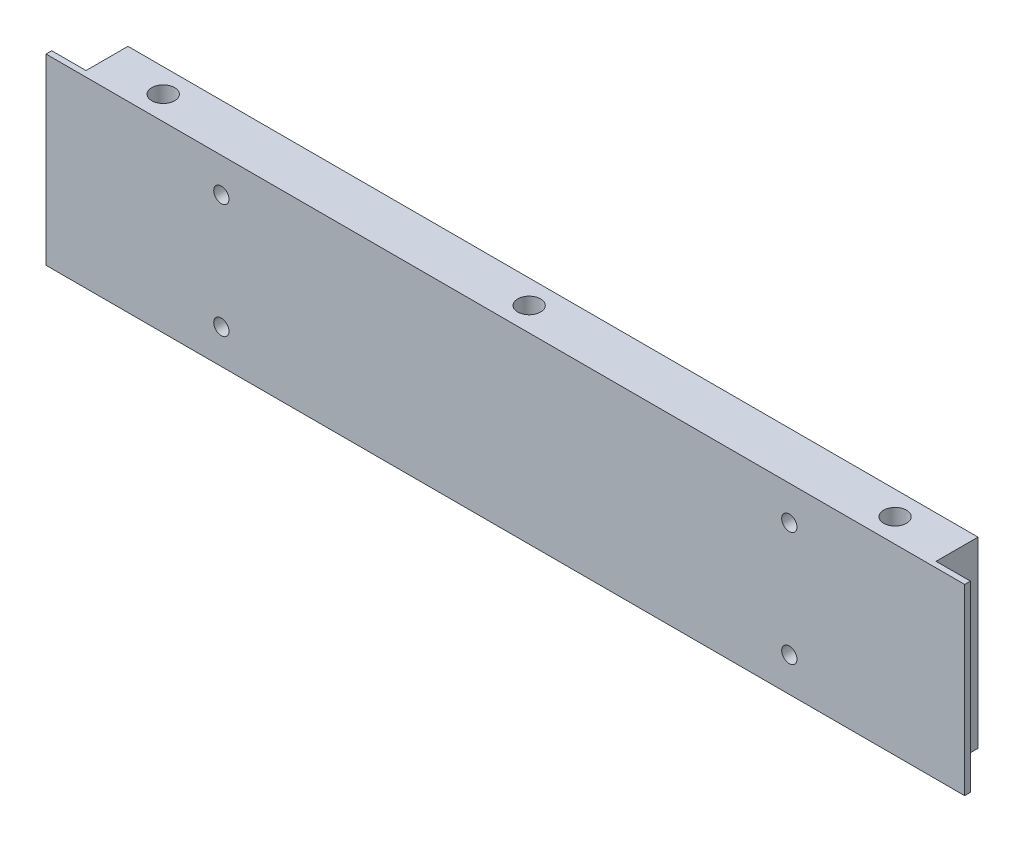
ISO-10303-21;
HEADER;
FILE_DESCRIPTION(('STEP AP214'),'2;1');
FILE_NAME('part.step','',(''),(''),'','','');
FILE_SCHEMA(('AUTOMOTIVE_DESIGN { 1 0 10303 214 1 1 1 1 }'));
ENDSEC;
DATA;
#1=APPLICATION_CONTEXT('core data for automotive mechanical design processes');
#2=APPLICATION_PROTOCOL_DEFINITION('international standard','automotive_design',2000,#1);
#3=PRODUCT_CONTEXT('',#1,'mechanical');
#4=PRODUCT('Part','Part','',(#3));
#5=PRODUCT_RELATED_PRODUCT_CATEGORY('part','',(#4));
#6=PRODUCT_DEFINITION_FORMATION('','',#4);
#7=PRODUCT_DEFINITION_CONTEXT('part definition',#1,'design');
#8=PRODUCT_DEFINITION('design','',#6,#7);
#9=PRODUCT_DEFINITION_SHAPE('','',#8);
#10=(LENGTH_UNIT() NAMED_UNIT(*) SI_UNIT(.MILLI.,.METRE.));
#11=(NAMED_UNIT(*) PLANE_ANGLE_UNIT() SI_UNIT($,.RADIAN.));
#12=(NAMED_UNIT(*) SI_UNIT($,.STERADIAN.) SOLID_ANGLE_UNIT());
#13=UNCERTAINTY_MEASURE_WITH_UNIT(LENGTH_MEASURE(1.E-05),#10,'distance_accuracy_value','');
#14=(GEOMETRIC_REPRESENTATION_CONTEXT(3) GLOBAL_UNCERTAINTY_ASSIGNED_CONTEXT((#13)) GLOBAL_UNIT_ASSIGNED_CONTEXT((#10,
#11,#12)) REPRESENTATION_CONTEXT('',''));
#15=CARTESIAN_POINT('',(0.,0.,0.));
#16=DIRECTION('',(0.,0.,1.));
#17=DIRECTION('',(1.,0.,0.));
#18=AXIS2_PLACEMENT_3D('',#15,#16,#17);
#19=CARTESIAN_POINT('',(0.,-48.,12.5));
#20=DIRECTION('',(0.,0.,1.));
#21=DIRECTION('',(1.,0.,0.));
#22=AXIS2_PLACEMENT_3D('',#19,#20,#21);
#23=PLANE('',#22);
#24=CARTESIAN_POINT('',(46.,-8.99999999999999,12.5));
#25=DIRECTION('',(0.,0.,1.));
#26=DIRECTION('',(1.,0.,0.));
#27=AXIS2_PLACEMENT_3D('',#24,#25,#26);
#28=CIRCLE('',#27,2.);
#29=CARTESIAN_POINT('',(48.,-8.99999999999999,12.5));
#30=VERTEX_POINT('',#29);
#31=EDGE_CURVE('E171',#30,#30,#28,.T.);
#32=ORIENTED_EDGE('',*,*,#31,.F.);
#33=EDGE_LOOP('',(#32));
#34=FACE_BOUND('',#33,.T.);
#35=CARTESIAN_POINT('',(195.,-39.,12.5));
#36=DIRECTION('',(0.,0.,1.));
#37=DIRECTION('',(-1.,0.,0.));
#38=AXIS2_PLACEMENT_3D('',#35,#36,#37);
#39=CIRCLE('',#38,2.00000000000002);
#40=CARTESIAN_POINT('',(193.,-39.,12.5));
#41=VERTEX_POINT('',#40);
#42=EDGE_CURVE('E120',#41,#41,#39,.T.);
#43=ORIENTED_EDGE('',*,*,#42,.F.);
#44=EDGE_LOOP('',(#43));
#45=FACE_BOUND('',#44,.T.);
#46=DIRECTION('',(0.,-1.,0.));
#47=VECTOR('',#46,1.);
#48=CARTESIAN_POINT('',(0.,0.,12.5));
#49=LINE('',#48,#47);
#50=CARTESIAN_POINT('',(0.,0.,12.5));
#51=VERTEX_POINT('',#50);
#52=CARTESIAN_POINT('',(0.,-48.,12.5));
#53=VERTEX_POINT('',#52);
#54=EDGE_CURVE('E122',#51,#53,#49,.T.);
#55=ORIENTED_EDGE('',*,*,#54,.T.);
#56=DIRECTION('',(1.,0.,0.));
#57=VECTOR('',#56,1.);
#58=CARTESIAN_POINT('',(0.,-48.,12.5));
#59=LINE('',#58,#57);
#60=CARTESIAN_POINT('',(241.,-48.,12.5));
#61=VERTEX_POINT('',#60);
#62=EDGE_CURVE('E146',#53,#61,#59,.T.);
#63=ORIENTED_EDGE('',*,*,#62,.T.);
#64=DIRECTION('',(0.,1.,0.));
#65=VECTOR('',#64,1.);
#66=CARTESIAN_POINT('',(241.,0.,12.5));
#67=LINE('',#66,#65);
#68=CARTESIAN_POINT('',(241.,0.,12.5));
#69=VERTEX_POINT('',#68);
#70=EDGE_CURVE('E144',#61,#69,#67,.T.);
#71=ORIENTED_EDGE('',*,*,#70,.T.);
#72=DIRECTION('',(-1.,0.,0.));
#73=VECTOR('',#72,1.);
#74=CARTESIAN_POINT('',(0.,0.,12.5));
#75=LINE('',#74,#73);
#76=EDGE_CURVE('E128',#69,#51,#75,.T.);
#77=ORIENTED_EDGE('',*,*,#76,.T.);
#78=EDGE_LOOP('',(#55,#63,#71,#77));
#79=FACE_BOUND('',#78,.T.);
#80=CARTESIAN_POINT('',(195.,-8.99999999999999,12.5));
#81=DIRECTION('',(0.,0.,1.));
#82=DIRECTION('',(-1.,0.,0.));
#83=AXIS2_PLACEMENT_3D('',#80,#81,#82);
#84=CIRCLE('',#83,2.00000000000002);
#85=CARTESIAN_POINT('',(193.,-8.99999999999999,12.5));
#86=VERTEX_POINT('',#85);
#87=EDGE_CURVE('E177',#86,#86,#84,.T.);
#88=ORIENTED_EDGE('',*,*,#87,.F.);
#89=EDGE_LOOP('',(#88));
#90=FACE_BOUND('',#89,.T.);
#91=CARTESIAN_POINT('',(46.,-39.,12.5));
#92=DIRECTION('',(0.,0.,1.));
#93=DIRECTION('',(1.,0.,0.));
#94=AXIS2_PLACEMENT_3D('',#91,#92,#93);
#95=CIRCLE('',#94,2.);
#96=CARTESIAN_POINT('',(48.,-39.,12.5));
#97=VERTEX_POINT('',#96);
#98=EDGE_CURVE('E165',#97,#97,#95,.T.);
#99=ORIENTED_EDGE('',*,*,#98,.F.);
#100=EDGE_LOOP('',(#99));
#101=FACE_BOUND('',#100,.T.);
#102=ADVANCED_FACE('F30',(#34,#45,#79,#90,#101),#23,.T.);
#103=CARTESIAN_POINT('',(0.,-48.,0.));
#104=DIRECTION('',(0.,0.,1.));
#105=DIRECTION('',(1.,0.,0.));
#106=AXIS2_PLACEMENT_3D('',#103,#104,#105);
#107=PLANE('',#106);
#108=CARTESIAN_POINT('',(46.,-8.99999999999999,0.));
#109=DIRECTION('',(0.,0.,1.));
#110=DIRECTION('',(1.,0.,0.));
#111=AXIS2_PLACEMENT_3D('',#108,#109,#110);
#112=CIRCLE('',#111,2.);
#113=CARTESIAN_POINT('',(48.,-8.99999999999999,0.));
#114=VERTEX_POINT('',#113);
#115=EDGE_CURVE('E168',#114,#114,#112,.T.);
#116=ORIENTED_EDGE('',*,*,#115,.T.);
#117=EDGE_LOOP('',(#116));
#118=FACE_BOUND('',#117,.T.);
#119=CARTESIAN_POINT('',(195.,-39.,0.));
#120=DIRECTION('',(0.,0.,1.));
#121=DIRECTION('',(-1.,0.,0.));
#122=AXIS2_PLACEMENT_3D('',#119,#120,#121);
#123=CIRCLE('',#122,2.00000000000002);
#124=CARTESIAN_POINT('',(193.,-39.,0.));
#125=VERTEX_POINT('',#124);
#126=EDGE_CURVE('E125',#125,#125,#123,.T.);
#127=ORIENTED_EDGE('',*,*,#126,.T.);
#128=EDGE_LOOP('',(#127));
#129=FACE_BOUND('',#128,.T.);
#130=DIRECTION('',(1.,0.,0.));
#131=VECTOR('',#130,1.);
#132=CARTESIAN_POINT('',(0.,-48.,0.));
#133=LINE('',#132,#131);
#134=CARTESIAN_POINT('',(9.00000000000001,-48.,0.));
#135=VERTEX_POINT('',#134);
#136=CARTESIAN_POINT('',(232.,-48.,0.));
#137=VERTEX_POINT('',#136);
#138=EDGE_CURVE('E114',#135,#137,#133,.T.);
#139=ORIENTED_EDGE('',*,*,#138,.F.);
#140=DIRECTION('',(0.,1.,0.));
#141=VECTOR('',#140,1.);
#142=CARTESIAN_POINT('',(9.00000000000001,-48.,0.));
#143=LINE('',#142,#141);
#144=CARTESIAN_POINT('',(9.00000000000001,0.,0.));
#145=VERTEX_POINT('',#144);
#146=EDGE_CURVE('E98',#135,#145,#143,.T.);
#147=ORIENTED_EDGE('',*,*,#146,.T.);
#148=DIRECTION('',(-1.,0.,0.));
#149=VECTOR('',#148,1.);
#150=CARTESIAN_POINT('',(0.,0.,0.));
#151=LINE('',#150,#149);
#152=CARTESIAN_POINT('',(232.,0.,0.));
#153=VERTEX_POINT('',#152);
#154=EDGE_CURVE('E119',#153,#145,#151,.T.);
#155=ORIENTED_EDGE('',*,*,#154,.F.);
#156=DIRECTION('',(0.,1.,0.));
#157=VECTOR('',#156,1.);
#158=CARTESIAN_POINT('',(232.,-48.,0.));
#159=LINE('',#158,#157);
#160=EDGE_CURVE('E53',#137,#153,#159,.T.);
#161=ORIENTED_EDGE('',*,*,#160,.F.);
#162=EDGE_LOOP('',(#139,#147,#155,#161));
#163=FACE_BOUND('',#162,.T.);
#164=CARTESIAN_POINT('',(195.,-8.99999999999999,0.));
#165=DIRECTION('',(0.,0.,1.));
#166=DIRECTION('',(-1.,0.,0.));
#167=AXIS2_PLACEMENT_3D('',#164,#165,#166);
#168=CIRCLE('',#167,2.00000000000002);
#169=CARTESIAN_POINT('',(193.,-8.99999999999999,0.));
#170=VERTEX_POINT('',#169);
#171=EDGE_CURVE('E174',#170,#170,#168,.T.);
#172=ORIENTED_EDGE('',*,*,#171,.T.);
#173=EDGE_LOOP('',(#172));
#174=FACE_BOUND('',#173,.T.);
#175=CARTESIAN_POINT('',(46.,-39.,0.));
#176=DIRECTION('',(0.,0.,1.));
#177=DIRECTION('',(1.,0.,0.));
#178=AXIS2_PLACEMENT_3D('',#175,#176,#177);
#179=CIRCLE('',#178,2.);
#180=CARTESIAN_POINT('',(48.,-39.,0.));
#181=VERTEX_POINT('',#180);
#182=EDGE_CURVE('E163',#181,#181,#179,.T.);
#183=ORIENTED_EDGE('',*,*,#182,.T.);
#184=EDGE_LOOP('',(#183));
#185=FACE_BOUND('',#184,.T.);
#186=ADVANCED_FACE('F117',(#118,#129,#163,#174,#185),#107,.F.);
#187=CARTESIAN_POINT('',(0.,0.,12.5));
#188=DIRECTION('',(1.,0.,0.));
#189=DIRECTION('',(0.,1.,0.));
#190=AXIS2_PLACEMENT_3D('',#187,#188,#189);
#191=PLANE('',#190);
#192=DIRECTION('',(0.,0.,-1.));
#193=VECTOR('',#192,1.);
#194=CARTESIAN_POINT('',(0.,0.,12.5));
#195=LINE('',#194,#193);
#196=CARTESIAN_POINT('',(0.,0.,11.));
#197=VERTEX_POINT('',#196);
#198=EDGE_CURVE('E131',#51,#197,#195,.T.);
#199=ORIENTED_EDGE('',*,*,#198,.T.);
#200=DIRECTION('',(0.,1.,0.));
#201=VECTOR('',#200,1.);
#202=CARTESIAN_POINT('',(0.,-48.,11.));
#203=LINE('',#202,#201);
#204=CARTESIAN_POINT('',(0.,-48.,11.));
#205=VERTEX_POINT('',#204);
#206=EDGE_CURVE('E45',#205,#197,#203,.T.);
#207=ORIENTED_EDGE('',*,*,#206,.F.);
#208=DIRECTION('',(0.,0.,-1.));
#209=VECTOR('',#208,1.);
#210=CARTESIAN_POINT('',(0.,-48.,12.5));
#211=LINE('',#210,#209);
#212=EDGE_CURVE('E11',#53,#205,#211,.T.);
#213=ORIENTED_EDGE('',*,*,#212,.F.);
#214=ORIENTED_EDGE('',*,*,#54,.F.);
#215=EDGE_LOOP('',(#199,#207,#213,#214));
#216=FACE_BOUND('',#215,.T.);
#217=ADVANCED_FACE('F32',(#216),#191,.F.);
#218=CARTESIAN_POINT('',(0.,-48.,12.5));
#219=DIRECTION('',(0.,1.,0.));
#220=DIRECTION('',(-1.,0.,0.));
#221=AXIS2_PLACEMENT_3D('',#218,#219,#220);
#222=PLANE('',#221);
#223=CARTESIAN_POINT('',(216.5,-48.,6.25000000000003));
#224=DIRECTION('',(0.,1.,0.));
#225=DIRECTION('',(-1.,0.,0.));
#226=AXIS2_PLACEMENT_3D('',#223,#224,#225);
#227=CIRCLE('',#226,3.00000000000002);
#228=CARTESIAN_POINT('',(213.5,-48.,6.25000000000003));
#229=VERTEX_POINT('',#228);
#230=EDGE_CURVE('E212',#229,#229,#227,.F.);
#231=ORIENTED_EDGE('',*,*,#230,.F.);
#232=EDGE_LOOP('',(#231));
#233=FACE_BOUND('',#232,.T.);
#234=CARTESIAN_POINT('',(24.5,-48.,6.25000000000003));
#235=DIRECTION('',(0.,1.,0.));
#236=DIRECTION('',(-1.,0.,0.));
#237=AXIS2_PLACEMENT_3D('',#234,#235,#236);
#238=CIRCLE('',#237,3.);
#239=CARTESIAN_POINT('',(21.5,-48.,6.25000000000003));
#240=VERTEX_POINT('',#239);
#241=EDGE_CURVE('E206',#240,#240,#238,.F.);
#242=ORIENTED_EDGE('',*,*,#241,.F.);
#243=EDGE_LOOP('',(#242));
#244=FACE_BOUND('',#243,.T.);
#245=CARTESIAN_POINT('',(120.5,-48.,6.25000000000003));
#246=DIRECTION('',(0.,1.,0.));
#247=DIRECTION('',(-1.,0.,0.));
#248=AXIS2_PLACEMENT_3D('',#245,#246,#247);
#249=CIRCLE('',#248,3.00000000000001);
#250=CARTESIAN_POINT('',(117.5,-48.,6.25000000000003));
#251=VERTEX_POINT('',#250);
#252=EDGE_CURVE('E199',#251,#251,#249,.F.);
#253=ORIENTED_EDGE('',*,*,#252,.F.);
#254=EDGE_LOOP('',(#253));
#255=FACE_BOUND('',#254,.T.);
#256=DIRECTION('',(1.,0.,0.));
#257=VECTOR('',#256,1.);
#258=CARTESIAN_POINT('',(9.,-48.,11.));
#259=LINE('',#258,#257);
#260=CARTESIAN_POINT('',(9.,-48.,11.));
#261=VERTEX_POINT('',#260);
#262=EDGE_CURVE('E109',#205,#261,#259,.T.);
#263=ORIENTED_EDGE('',*,*,#262,.T.);
#264=DIRECTION('',(0.,0.,-1.));
#265=VECTOR('',#264,1.);
#266=CARTESIAN_POINT('',(9.00000000000001,-48.,0.));
#267=LINE('',#266,#265);
#268=EDGE_CURVE('E101',#261,#135,#267,.T.);
#269=ORIENTED_EDGE('',*,*,#268,.T.);
#270=ORIENTED_EDGE('',*,*,#138,.T.);
#271=DIRECTION('',(0.,0.,1.));
#272=VECTOR('',#271,1.);
#273=CARTESIAN_POINT('',(232.,-48.,0.));
#274=LINE('',#273,#272);
#275=CARTESIAN_POINT('',(232.,-48.,11.));
#276=VERTEX_POINT('',#275);
#277=EDGE_CURVE('E150',#137,#276,#274,.T.);
#278=ORIENTED_EDGE('',*,*,#277,.T.);
#279=DIRECTION('',(1.,0.,0.));
#280=VECTOR('',#279,1.);
#281=CARTESIAN_POINT('',(232.,-48.,11.));
#282=LINE('',#281,#280);
#283=CARTESIAN_POINT('',(241.,-48.,11.));
#284=VERTEX_POINT('',#283);
#285=EDGE_CURVE('E149',#276,#284,#282,.T.);
#286=ORIENTED_EDGE('',*,*,#285,.T.);
#287=DIRECTION('',(0.,0.,-1.));
#288=VECTOR('',#287,1.);
#289=CARTESIAN_POINT('',(241.,-48.,12.5));
#290=LINE('',#289,#288);
#291=EDGE_CURVE('E38',#61,#284,#290,.T.);
#292=ORIENTED_EDGE('',*,*,#291,.F.);
#293=ORIENTED_EDGE('',*,*,#62,.F.);
#294=ORIENTED_EDGE('',*,*,#212,.T.);
#295=EDGE_LOOP('',(#263,#269,#270,#278,#286,#292,#293,#294));
#296=FACE_BOUND('',#295,.T.);
#297=ADVANCED_FACE('F112',(#233,#244,#255,#296),#222,.F.);
#298=CARTESIAN_POINT('',(241.,0.,12.5));
#299=DIRECTION('',(-1.,0.,0.));
#300=DIRECTION('',(0.,0.,1.));
#301=AXIS2_PLACEMENT_3D('',#298,#299,#300);
#302=PLANE('',#301);
#303=ORIENTED_EDGE('',*,*,#291,.T.);
#304=DIRECTION('',(0.,1.,0.));
#305=VECTOR('',#304,1.);
#306=CARTESIAN_POINT('',(241.,-48.,11.));
#307=LINE('',#306,#305);
#308=CARTESIAN_POINT('',(241.,0.,11.));
#309=VERTEX_POINT('',#308);
#310=EDGE_CURVE('E143',#284,#309,#307,.T.);
#311=ORIENTED_EDGE('',*,*,#310,.T.);
#312=DIRECTION('',(0.,0.,-1.));
#313=VECTOR('',#312,1.);
#314=CARTESIAN_POINT('',(241.,0.,12.5));
#315=LINE('',#314,#313);
#316=EDGE_CURVE('E134',#69,#309,#315,.T.);
#317=ORIENTED_EDGE('',*,*,#316,.F.);
#318=ORIENTED_EDGE('',*,*,#70,.F.);
#319=EDGE_LOOP('',(#303,#311,#317,#318));
#320=FACE_BOUND('',#319,.T.);
#321=ADVANCED_FACE('F141',(#320),#302,.F.);
#322=CARTESIAN_POINT('',(0.,0.,12.5));
#323=DIRECTION('',(0.,-1.,0.));
#324=DIRECTION('',(1.,0.,0.));
#325=AXIS2_PLACEMENT_3D('',#322,#323,#324);
#326=PLANE('',#325);
#327=CARTESIAN_POINT('',(216.5,0.,6.25000000000003));
#328=DIRECTION('',(0.,1.,0.));
#329=DIRECTION('',(1.,0.,0.));
#330=AXIS2_PLACEMENT_3D('',#327,#328,#329);
#331=CIRCLE('',#330,3.00000000000002);
#332=CARTESIAN_POINT('',(219.5,0.,6.25000000000003));
#333=VERTEX_POINT('',#332);
#334=EDGE_CURVE('E215',#333,#333,#331,.T.);
#335=ORIENTED_EDGE('',*,*,#334,.F.);
#336=EDGE_LOOP('',(#335));
#337=FACE_BOUND('',#336,.T.);
#338=CARTESIAN_POINT('',(24.5,0.,6.25000000000003));
#339=DIRECTION('',(0.,1.,0.));
#340=DIRECTION('',(-1.,0.,0.));
#341=AXIS2_PLACEMENT_3D('',#338,#339,#340);
#342=CIRCLE('',#341,3.);
#343=CARTESIAN_POINT('',(21.5,0.,6.25000000000003));
#344=VERTEX_POINT('',#343);
#345=EDGE_CURVE('E209',#344,#344,#342,.T.);
#346=ORIENTED_EDGE('',*,*,#345,.F.);
#347=EDGE_LOOP('',(#346));
#348=FACE_BOUND('',#347,.T.);
#349=CARTESIAN_POINT('',(120.5,0.,6.25000000000003));
#350=DIRECTION('',(0.,1.,0.));
#351=DIRECTION('',(-1.,0.,0.));
#352=AXIS2_PLACEMENT_3D('',#349,#350,#351);
#353=CIRCLE('',#352,3.00000000000001);
#354=CARTESIAN_POINT('',(117.5,0.,6.25000000000003));
#355=VERTEX_POINT('',#354);
#356=EDGE_CURVE('E203',#355,#355,#353,.T.);
#357=ORIENTED_EDGE('',*,*,#356,.F.);
#358=EDGE_LOOP('',(#357));
#359=FACE_BOUND('',#358,.T.);
#360=ORIENTED_EDGE('',*,*,#154,.T.);
#361=DIRECTION('',(0.,0.,-1.));
#362=VECTOR('',#361,1.);
#363=CARTESIAN_POINT('',(9.00000000000001,0.,0.));
#364=LINE('',#363,#362);
#365=CARTESIAN_POINT('',(9.,0.,11.));
#366=VERTEX_POINT('',#365);
#367=EDGE_CURVE('E104',#366,#145,#364,.T.);
#368=ORIENTED_EDGE('',*,*,#367,.F.);
#369=DIRECTION('',(1.,0.,0.));
#370=VECTOR('',#369,1.);
#371=CARTESIAN_POINT('',(9.,0.,11.));
#372=LINE('',#371,#370);
#373=EDGE_CURVE('E115',#197,#366,#372,.T.);
#374=ORIENTED_EDGE('',*,*,#373,.F.);
#375=ORIENTED_EDGE('',*,*,#198,.F.);
#376=ORIENTED_EDGE('',*,*,#76,.F.);
#377=ORIENTED_EDGE('',*,*,#316,.T.);
#378=DIRECTION('',(1.,0.,0.));
#379=VECTOR('',#378,1.);
#380=CARTESIAN_POINT('',(232.,0.,11.));
#381=LINE('',#380,#379);
#382=CARTESIAN_POINT('',(232.,0.,11.));
#383=VERTEX_POINT('',#382);
#384=EDGE_CURVE('E155',#383,#309,#381,.T.);
#385=ORIENTED_EDGE('',*,*,#384,.F.);
#386=DIRECTION('',(0.,0.,1.));
#387=VECTOR('',#386,1.);
#388=CARTESIAN_POINT('',(232.,0.,0.));
#389=LINE('',#388,#387);
#390=EDGE_CURVE('E158',#153,#383,#389,.T.);
#391=ORIENTED_EDGE('',*,*,#390,.F.);
#392=EDGE_LOOP('',(#360,#368,#374,#375,#376,#377,#385,#391));
#393=FACE_BOUND('',#392,.T.);
#394=ADVANCED_FACE('F192',(#337,#348,#359,#393),#326,.F.);
#395=CARTESIAN_POINT('',(195.,-39.,12.5));
#396=DIRECTION('',(0.,0.,-1.));
#397=DIRECTION('',(-1.,0.,0.));
#398=AXIS2_PLACEMENT_3D('',#395,#396,#397);
#399=CYLINDRICAL_SURFACE('',#398,2.00000000000002);
#400=ORIENTED_EDGE('',*,*,#42,.T.);
#401=EDGE_LOOP('',(#400));
#402=FACE_BOUND('',#401,.T.);
#403=ORIENTED_EDGE('',*,*,#126,.F.);
#404=EDGE_LOOP('',(#403));
#405=FACE_BOUND('',#404,.T.);
#406=ADVANCED_FACE('F224',(#402,#405),#399,.F.);
#407=CARTESIAN_POINT('',(195.,-8.99999999999999,12.5));
#408=DIRECTION('',(0.,0.,-1.));
#409=DIRECTION('',(-1.,0.,0.));
#410=AXIS2_PLACEMENT_3D('',#407,#408,#409);
#411=CYLINDRICAL_SURFACE('',#410,2.00000000000002);
#412=ORIENTED_EDGE('',*,*,#87,.T.);
#413=EDGE_LOOP('',(#412));
#414=FACE_BOUND('',#413,.T.);
#415=ORIENTED_EDGE('',*,*,#171,.F.);
#416=EDGE_LOOP('',(#415));
#417=FACE_BOUND('',#416,.T.);
#418=ADVANCED_FACE('F260',(#414,#417),#411,.F.);
#419=CARTESIAN_POINT('',(46.,-8.99999999999999,12.5));
#420=DIRECTION('',(0.,0.,-1.));
#421=DIRECTION('',(-1.,0.,0.));
#422=AXIS2_PLACEMENT_3D('',#419,#420,#421);
#423=CYLINDRICAL_SURFACE('',#422,2.);
#424=ORIENTED_EDGE('',*,*,#31,.T.);
#425=EDGE_LOOP('',(#424));
#426=FACE_BOUND('',#425,.T.);
#427=ORIENTED_EDGE('',*,*,#115,.F.);
#428=EDGE_LOOP('',(#427));
#429=FACE_BOUND('',#428,.T.);
#430=ADVANCED_FACE('F264',(#426,#429),#423,.F.);
#431=CARTESIAN_POINT('',(46.,-39.,12.5));
#432=DIRECTION('',(0.,0.,-1.));
#433=DIRECTION('',(-1.,0.,0.));
#434=AXIS2_PLACEMENT_3D('',#431,#432,#433);
#435=CYLINDRICAL_SURFACE('',#434,2.);
#436=ORIENTED_EDGE('',*,*,#98,.T.);
#437=EDGE_LOOP('',(#436));
#438=FACE_BOUND('',#437,.T.);
#439=ORIENTED_EDGE('',*,*,#182,.F.);
#440=EDGE_LOOP('',(#439));
#441=FACE_BOUND('',#440,.T.);
#442=ADVANCED_FACE('F268',(#438,#441),#435,.F.);
#443=CARTESIAN_POINT('',(232.,-48.,11.));
#444=DIRECTION('',(0.,0.,1.));
#445=DIRECTION('',(1.,0.,0.));
#446=AXIS2_PLACEMENT_3D('',#443,#444,#445);
#447=PLANE('',#446);
#448=ORIENTED_EDGE('',*,*,#384,.T.);
#449=ORIENTED_EDGE('',*,*,#310,.F.);
#450=ORIENTED_EDGE('',*,*,#285,.F.);
#451=DIRECTION('',(0.,1.,0.));
#452=VECTOR('',#451,1.);
#453=CARTESIAN_POINT('',(232.,-48.,11.));
#454=LINE('',#453,#452);
#455=EDGE_CURVE('E153',#276,#383,#454,.T.);
#456=ORIENTED_EDGE('',*,*,#455,.T.);
#457=EDGE_LOOP('',(#448,#449,#450,#456));
#458=FACE_BOUND('',#457,.T.);
#459=ADVANCED_FACE('F272',(#458),#447,.F.);
#460=CARTESIAN_POINT('',(232.,-48.,0.));
#461=DIRECTION('',(-1.,0.,0.));
#462=DIRECTION('',(0.,0.,1.));
#463=AXIS2_PLACEMENT_3D('',#460,#461,#462);
#464=PLANE('',#463);
#465=ORIENTED_EDGE('',*,*,#390,.T.);
#466=ORIENTED_EDGE('',*,*,#455,.F.);
#467=ORIENTED_EDGE('',*,*,#277,.F.);
#468=ORIENTED_EDGE('',*,*,#160,.T.);
#469=EDGE_LOOP('',(#465,#466,#467,#468));
#470=FACE_BOUND('',#469,.T.);
#471=ADVANCED_FACE('F274',(#470),#464,.F.);
#472=CARTESIAN_POINT('',(9.00000000000001,-48.,0.));
#473=DIRECTION('',(1.,0.,0.));
#474=DIRECTION('',(0.,0.,-1.));
#475=AXIS2_PLACEMENT_3D('',#472,#473,#474);
#476=PLANE('',#475);
#477=ORIENTED_EDGE('',*,*,#367,.T.);
#478=ORIENTED_EDGE('',*,*,#146,.F.);
#479=ORIENTED_EDGE('',*,*,#268,.F.);
#480=DIRECTION('',(0.,1.,0.));
#481=VECTOR('',#480,1.);
#482=CARTESIAN_POINT('',(9.,-48.,11.));
#483=LINE('',#482,#481);
#484=EDGE_CURVE('E160',#261,#366,#483,.T.);
#485=ORIENTED_EDGE('',*,*,#484,.T.);
#486=EDGE_LOOP('',(#477,#478,#479,#485));
#487=FACE_BOUND('',#486,.T.);
#488=ADVANCED_FACE('F100',(#487),#476,.F.);
#489=CARTESIAN_POINT('',(9.,-48.,11.));
#490=DIRECTION('',(0.,0.,1.));
#491=DIRECTION('',(1.,0.,0.));
#492=AXIS2_PLACEMENT_3D('',#489,#490,#491);
#493=PLANE('',#492);
#494=ORIENTED_EDGE('',*,*,#373,.T.);
#495=ORIENTED_EDGE('',*,*,#484,.F.);
#496=ORIENTED_EDGE('',*,*,#262,.F.);
#497=ORIENTED_EDGE('',*,*,#206,.T.);
#498=EDGE_LOOP('',(#494,#495,#496,#497));
#499=FACE_BOUND('',#498,.T.);
#500=ADVANCED_FACE('F234',(#499),#493,.F.);
#501=CARTESIAN_POINT('',(120.5,-48.001,6.25000000000003));
#502=DIRECTION('',(0.,1.,0.));
#503=DIRECTION('',(-1.,0.,0.));
#504=AXIS2_PLACEMENT_3D('',#501,#502,#503);
#505=CYLINDRICAL_SURFACE('',#504,3.00000000000001);
#506=ORIENTED_EDGE('',*,*,#356,.T.);
#507=EDGE_LOOP('',(#506));
#508=FACE_BOUND('',#507,.T.);
#509=ORIENTED_EDGE('',*,*,#252,.T.);
#510=EDGE_LOOP('',(#509));
#511=FACE_BOUND('',#510,.T.);
#512=ADVANCED_FACE('F230',(#508,#511),#505,.F.);
#513=CARTESIAN_POINT('',(24.5,-48.001,6.25000000000003));
#514=DIRECTION('',(0.,1.,0.));
#515=DIRECTION('',(-1.,0.,0.));
#516=AXIS2_PLACEMENT_3D('',#513,#514,#515);
#517=CYLINDRICAL_SURFACE('',#516,3.);
#518=ORIENTED_EDGE('',*,*,#345,.T.);
#519=EDGE_LOOP('',(#518));
#520=FACE_BOUND('',#519,.T.);
#521=ORIENTED_EDGE('',*,*,#241,.T.);
#522=EDGE_LOOP('',(#521));
#523=FACE_BOUND('',#522,.T.);
#524=ADVANCED_FACE('F233',(#520,#523),#517,.F.);
#525=CARTESIAN_POINT('',(216.5,-48.001,6.25000000000003));
#526=DIRECTION('',(0.,1.,0.));
#527=DIRECTION('',(-1.,0.,0.));
#528=AXIS2_PLACEMENT_3D('',#525,#526,#527);
#529=CYLINDRICAL_SURFACE('',#528,3.00000000000002);
#530=ORIENTED_EDGE('',*,*,#334,.T.);
#531=EDGE_LOOP('',(#530));
#532=FACE_BOUND('',#531,.T.);
#533=ORIENTED_EDGE('',*,*,#230,.T.);
#534=EDGE_LOOP('',(#533));
#535=FACE_BOUND('',#534,.T.);
#536=ADVANCED_FACE('F219',(#532,#535),#529,.F.);
#537=CLOSED_SHELL('',(#102,#186,#217,#297,#321,#394,#406,#418,#430,#442,#459,#471,#488,#500,
#512,#524,#536));
#538=MANIFOLD_SOLID_BREP('B2',#537);
#539=ADVANCED_BREP_SHAPE_REPRESENTATION('',(#18,#538),#14);
#540=SHAPE_DEFINITION_REPRESENTATION(#9,#539);
ENDSEC;
END-ISO-10303-21;
